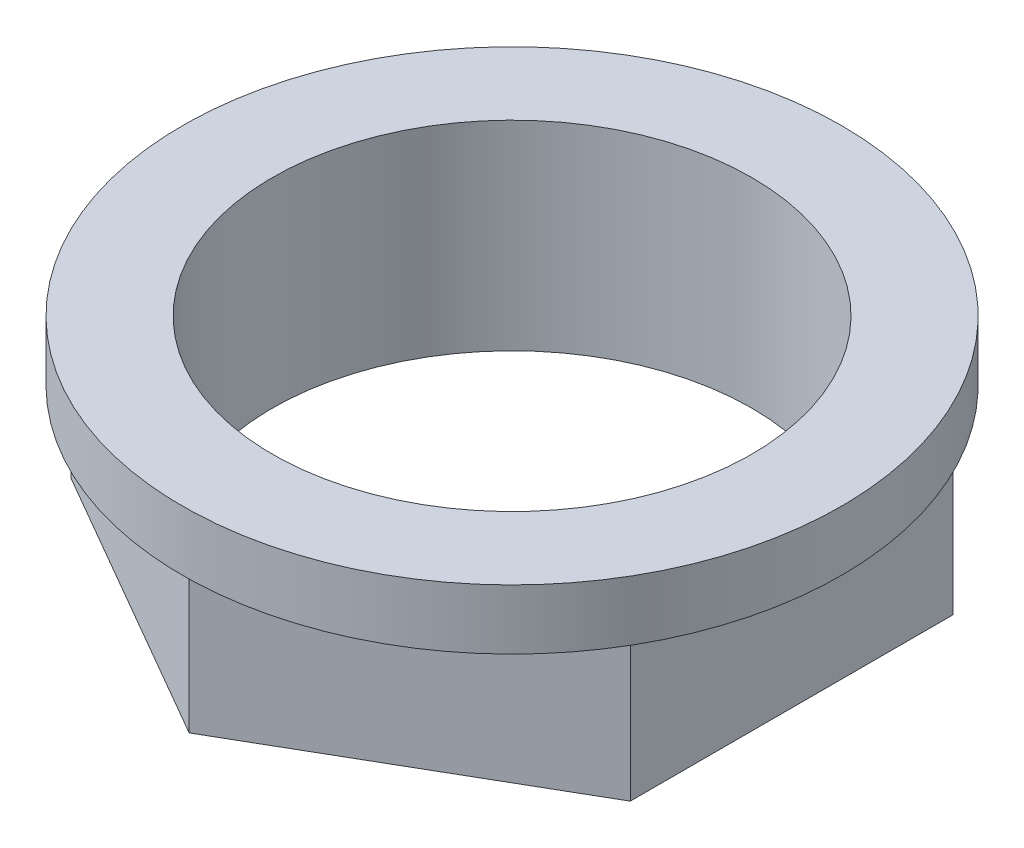
ISO-10303-21;
HEADER;
FILE_DESCRIPTION(('STEP AP214'),'2;1');
FILE_NAME('part.step','',(''),(''),'','','');
FILE_SCHEMA(('AUTOMOTIVE_DESIGN { 1 0 10303 214 1 1 1 1 }'));
ENDSEC;
DATA;
#1=APPLICATION_CONTEXT('core data for automotive mechanical design processes');
#2=APPLICATION_PROTOCOL_DEFINITION('international standard','automotive_design',2000,#1);
#3=PRODUCT_CONTEXT('',#1,'mechanical');
#4=PRODUCT('Part','Part','',(#3));
#5=PRODUCT_RELATED_PRODUCT_CATEGORY('part','',(#4));
#6=PRODUCT_DEFINITION_FORMATION('','',#4);
#7=PRODUCT_DEFINITION_CONTEXT('part definition',#1,'design');
#8=PRODUCT_DEFINITION('design','',#6,#7);
#9=PRODUCT_DEFINITION_SHAPE('','',#8);
#10=(LENGTH_UNIT() NAMED_UNIT(*) SI_UNIT(.MILLI.,.METRE.));
#11=(NAMED_UNIT(*) PLANE_ANGLE_UNIT() SI_UNIT($,.RADIAN.));
#12=(NAMED_UNIT(*) SI_UNIT($,.STERADIAN.) SOLID_ANGLE_UNIT());
#13=UNCERTAINTY_MEASURE_WITH_UNIT(LENGTH_MEASURE(1.E-05),#10,'distance_accuracy_value','');
#14=(GEOMETRIC_REPRESENTATION_CONTEXT(3) GLOBAL_UNCERTAINTY_ASSIGNED_CONTEXT((#13)) GLOBAL_UNIT_ASSIGNED_CONTEXT((#10,
#11,#12)) REPRESENTATION_CONTEXT('',''));
#15=CARTESIAN_POINT('',(0.,0.,0.));
#16=DIRECTION('',(0.,0.,1.));
#17=DIRECTION('',(1.,0.,0.));
#18=AXIS2_PLACEMENT_3D('',#15,#16,#17);
#19=CARTESIAN_POINT('',(0.,-3.49659483037718,0.));
#20=DIRECTION('',(0.,-1.,0.));
#21=DIRECTION('',(0.,0.,-1.));
#22=AXIS2_PLACEMENT_3D('',#19,#20,#21);
#23=CYLINDRICAL_SURFACE('',#22,8.25);
#24=CARTESIAN_POINT('',(0.,0.,0.));
#25=DIRECTION('',(0.,-1.,0.));
#26=DIRECTION('',(0.,0.,-1.));
#27=AXIS2_PLACEMENT_3D('',#24,#25,#26);
#28=CIRCLE('',#27,8.25);
#29=CARTESIAN_POINT('',(0.,0.,-8.25));
#30=VERTEX_POINT('',#29);
#31=EDGE_CURVE('E143',#30,#30,#28,.T.);
#32=ORIENTED_EDGE('',*,*,#31,.T.);
#33=EDGE_LOOP('',(#32));
#34=FACE_BOUND('',#33,.T.);
#35=CARTESIAN_POINT('',(0.,-1.5,0.));
#36=DIRECTION('',(0.,-1.,0.));
#37=DIRECTION('',(0.,0.,-1.));
#38=AXIS2_PLACEMENT_3D('',#35,#36,#37);
#39=CIRCLE('',#38,8.25);
#40=CARTESIAN_POINT('',(0.,-1.5,-8.25));
#41=VERTEX_POINT('',#40);
#42=EDGE_CURVE('E133',#41,#41,#39,.T.);
#43=ORIENTED_EDGE('',*,*,#42,.F.);
#44=EDGE_LOOP('',(#43));
#45=FACE_BOUND('',#44,.T.);
#46=ADVANCED_FACE('F34',(#34,#45),#23,.T.);
#47=CARTESIAN_POINT('',(-8.25,-5.,0.));
#48=DIRECTION('',(0.,1.,0.));
#49=DIRECTION('',(0.,0.,1.));
#50=AXIS2_PLACEMENT_3D('',#47,#48,#49);
#51=PLANE('',#50);
#52=CARTESIAN_POINT('',(0.,-5.,0.));
#53=DIRECTION('',(0.,-1.,0.));
#54=DIRECTION('',(0.,0.,-1.));
#55=AXIS2_PLACEMENT_3D('',#52,#53,#54);
#56=CIRCLE('',#55,6.);
#57=CARTESIAN_POINT('',(0.,-5.,-6.));
#58=VERTEX_POINT('',#57);
#59=EDGE_CURVE('E11',#58,#58,#56,.T.);
#60=ORIENTED_EDGE('',*,*,#59,.F.);
#61=EDGE_LOOP('',(#60));
#62=FACE_BOUND('',#61,.T.);
#63=DIRECTION('',(-0.866025403784438,0.,0.5));
#64=VECTOR('',#63,1.);
#65=CARTESIAN_POINT('',(7.,-5.,4.04145188432738));
#66=LINE('',#65,#64);
#67=CARTESIAN_POINT('',(7.,-5.,4.04145188432738));
#68=VERTEX_POINT('',#67);
#69=CARTESIAN_POINT('',(0.,-5.,8.08290376865476));
#70=VERTEX_POINT('',#69);
#71=EDGE_CURVE('E123',#68,#70,#66,.T.);
#72=ORIENTED_EDGE('',*,*,#71,.T.);
#73=DIRECTION('',(-0.866025403784439,0.,-0.5));
#74=VECTOR('',#73,1.);
#75=CARTESIAN_POINT('',(0.,-5.,8.08290376865476));
#76=LINE('',#75,#74);
#77=CARTESIAN_POINT('',(-7.,-5.,4.04145188432738));
#78=VERTEX_POINT('',#77);
#79=EDGE_CURVE('E92',#70,#78,#76,.T.);
#80=ORIENTED_EDGE('',*,*,#79,.T.);
#81=DIRECTION('',(0.,0.,-1.));
#82=VECTOR('',#81,1.);
#83=CARTESIAN_POINT('',(-7.,-5.,4.04145188432738));
#84=LINE('',#83,#82);
#85=CARTESIAN_POINT('',(-7.,-5.,-4.04145188432738));
#86=VERTEX_POINT('',#85);
#87=EDGE_CURVE('E48',#78,#86,#84,.T.);
#88=ORIENTED_EDGE('',*,*,#87,.T.);
#89=DIRECTION('',(0.866025403784439,0.,-0.5));
#90=VECTOR('',#89,1.);
#91=CARTESIAN_POINT('',(-7.,-5.,-4.04145188432738));
#92=LINE('',#91,#90);
#93=CARTESIAN_POINT('',(0.,-5.,-8.08290376865476));
#94=VERTEX_POINT('',#93);
#95=EDGE_CURVE('E127',#86,#94,#92,.T.);
#96=ORIENTED_EDGE('',*,*,#95,.T.);
#97=DIRECTION('',(0.866025403784439,0.,0.5));
#98=VECTOR('',#97,1.);
#99=CARTESIAN_POINT('',(0.,-5.,-8.08290376865476));
#100=LINE('',#99,#98);
#101=CARTESIAN_POINT('',(7.,-5.,-4.04145188432738));
#102=VERTEX_POINT('',#101);
#103=EDGE_CURVE('E112',#94,#102,#100,.T.);
#104=ORIENTED_EDGE('',*,*,#103,.T.);
#105=DIRECTION('',(0.,0.,1.));
#106=VECTOR('',#105,1.);
#107=CARTESIAN_POINT('',(7.,-5.,-4.04145188432738));
#108=LINE('',#107,#106);
#109=EDGE_CURVE('E109',#102,#68,#108,.T.);
#110=ORIENTED_EDGE('',*,*,#109,.T.);
#111=EDGE_LOOP('',(#72,#80,#88,#96,#104,#110));
#112=FACE_BOUND('',#111,.T.);
#113=ADVANCED_FACE('F153',(#62,#112),#51,.F.);
#114=CARTESIAN_POINT('',(0.,-3.49659483037718,0.));
#115=DIRECTION('',(0.,-1.,0.));
#116=DIRECTION('',(0.,0.,-1.));
#117=AXIS2_PLACEMENT_3D('',#114,#115,#116);
#118=CYLINDRICAL_SURFACE('',#117,6.);
#119=CARTESIAN_POINT('',(0.,0.,0.));
#120=DIRECTION('',(0.,-1.,0.));
#121=DIRECTION('',(0.,0.,-1.));
#122=AXIS2_PLACEMENT_3D('',#119,#120,#121);
#123=CIRCLE('',#122,6.);
#124=CARTESIAN_POINT('',(0.,0.,-6.));
#125=VERTEX_POINT('',#124);
#126=EDGE_CURVE('E41',#125,#125,#123,.T.);
#127=ORIENTED_EDGE('',*,*,#126,.F.);
#128=EDGE_LOOP('',(#127));
#129=FACE_BOUND('',#128,.T.);
#130=ORIENTED_EDGE('',*,*,#59,.T.);
#131=EDGE_LOOP('',(#130));
#132=FACE_BOUND('',#131,.T.);
#133=ADVANCED_FACE('F150',(#129,#132),#118,.F.);
#134=CARTESIAN_POINT('',(-8.25,0.,0.));
#135=DIRECTION('',(0.,-1.,0.));
#136=DIRECTION('',(0.,0.,-1.));
#137=AXIS2_PLACEMENT_3D('',#134,#135,#136);
#138=PLANE('',#137);
#139=ORIENTED_EDGE('',*,*,#31,.F.);
#140=EDGE_LOOP('',(#139));
#141=FACE_BOUND('',#140,.T.);
#142=ORIENTED_EDGE('',*,*,#126,.T.);
#143=EDGE_LOOP('',(#142));
#144=FACE_BOUND('',#143,.T.);
#145=ADVANCED_FACE('F148',(#141,#144),#138,.F.);
#146=CARTESIAN_POINT('',(0.,-1.5,0.));
#147=DIRECTION('',(0.,-1.,0.));
#148=DIRECTION('',(0.,0.,-1.));
#149=AXIS2_PLACEMENT_3D('',#146,#147,#148);
#150=PLANE('',#149);
#151=DIRECTION('',(0.,0.,1.));
#152=VECTOR('',#151,1.);
#153=CARTESIAN_POINT('',(7.,-1.5,-4.04145188432738));
#154=LINE('',#153,#152);
#155=CARTESIAN_POINT('',(7.,-1.5,-4.04145188432738));
#156=VERTEX_POINT('',#155);
#157=CARTESIAN_POINT('',(7.,-1.5,4.04145188432738));
#158=VERTEX_POINT('',#157);
#159=EDGE_CURVE('E98',#156,#158,#154,.T.);
#160=ORIENTED_EDGE('',*,*,#159,.F.);
#161=DIRECTION('',(0.866025403784439,0.,0.5));
#162=VECTOR('',#161,1.);
#163=CARTESIAN_POINT('',(0.,-1.5,-8.08290376865476));
#164=LINE('',#163,#162);
#165=CARTESIAN_POINT('',(0.,-1.5,-8.08290376865476));
#166=VERTEX_POINT('',#165);
#167=EDGE_CURVE('E119',#166,#156,#164,.T.);
#168=ORIENTED_EDGE('',*,*,#167,.F.);
#169=DIRECTION('',(0.866025403784439,0.,-0.5));
#170=VECTOR('',#169,1.);
#171=CARTESIAN_POINT('',(-7.,-1.5,-4.04145188432738));
#172=LINE('',#171,#170);
#173=CARTESIAN_POINT('',(-7.,-1.5,-4.04145188432738));
#174=VERTEX_POINT('',#173);
#175=EDGE_CURVE('E116',#174,#166,#172,.T.);
#176=ORIENTED_EDGE('',*,*,#175,.F.);
#177=DIRECTION('',(0.,0.,-1.));
#178=VECTOR('',#177,1.);
#179=CARTESIAN_POINT('',(-7.,-1.5,4.04145188432738));
#180=LINE('',#179,#178);
#181=CARTESIAN_POINT('',(-7.,-1.5,4.04145188432738));
#182=VERTEX_POINT('',#181);
#183=EDGE_CURVE('E56',#182,#174,#180,.T.);
#184=ORIENTED_EDGE('',*,*,#183,.F.);
#185=DIRECTION('',(-0.866025403784439,0.,-0.5));
#186=VECTOR('',#185,1.);
#187=CARTESIAN_POINT('',(0.,-1.5,8.08290376865476));
#188=LINE('',#187,#186);
#189=CARTESIAN_POINT('',(0.,-1.5,8.08290376865476));
#190=VERTEX_POINT('',#189);
#191=EDGE_CURVE('E90',#190,#182,#188,.T.);
#192=ORIENTED_EDGE('',*,*,#191,.F.);
#193=DIRECTION('',(-0.866025403784438,0.,0.5));
#194=VECTOR('',#193,1.);
#195=CARTESIAN_POINT('',(7.,-1.5,4.04145188432738));
#196=LINE('',#195,#194);
#197=EDGE_CURVE('E104',#158,#190,#196,.T.);
#198=ORIENTED_EDGE('',*,*,#197,.F.);
#199=EDGE_LOOP('',(#160,#168,#176,#184,#192,#198));
#200=FACE_BOUND('',#199,.T.);
#201=ORIENTED_EDGE('',*,*,#42,.T.);
#202=EDGE_LOOP('',(#201));
#203=FACE_BOUND('',#202,.T.);
#204=ADVANCED_FACE('F102',(#200,#203),#150,.T.);
#205=CARTESIAN_POINT('',(7.,-1.5,4.04145188432738));
#206=DIRECTION('',(0.5,0.,0.866025403784438));
#207=DIRECTION('',(0.866025403784439,0.,-0.5));
#208=AXIS2_PLACEMENT_3D('',#205,#206,#207);
#209=PLANE('',#208);
#210=ORIENTED_EDGE('',*,*,#71,.F.);
#211=DIRECTION('',(0.,-1.,0.));
#212=VECTOR('',#211,1.);
#213=CARTESIAN_POINT('',(7.,-1.5,4.04145188432738));
#214=LINE('',#213,#212);
#215=EDGE_CURVE('E108',#158,#68,#214,.T.);
#216=ORIENTED_EDGE('',*,*,#215,.F.);
#217=ORIENTED_EDGE('',*,*,#197,.T.);
#218=DIRECTION('',(0.,-1.,0.));
#219=VECTOR('',#218,1.);
#220=CARTESIAN_POINT('',(0.,-1.5,8.08290376865476));
#221=LINE('',#220,#219);
#222=EDGE_CURVE('E88',#190,#70,#221,.T.);
#223=ORIENTED_EDGE('',*,*,#222,.T.);
#224=EDGE_LOOP('',(#210,#216,#217,#223));
#225=FACE_BOUND('',#224,.T.);
#226=ADVANCED_FACE('F107',(#225),#209,.T.);
#227=CARTESIAN_POINT('',(7.,-1.5,-4.04145188432738));
#228=DIRECTION('',(1.,0.,0.));
#229=DIRECTION('',(0.,0.,-1.));
#230=AXIS2_PLACEMENT_3D('',#227,#228,#229);
#231=PLANE('',#230);
#232=ORIENTED_EDGE('',*,*,#109,.F.);
#233=DIRECTION('',(0.,-1.,0.));
#234=VECTOR('',#233,1.);
#235=CARTESIAN_POINT('',(7.,-1.5,-4.04145188432738));
#236=LINE('',#235,#234);
#237=EDGE_CURVE('E134',#156,#102,#236,.T.);
#238=ORIENTED_EDGE('',*,*,#237,.F.);
#239=ORIENTED_EDGE('',*,*,#159,.T.);
#240=ORIENTED_EDGE('',*,*,#215,.T.);
#241=EDGE_LOOP('',(#232,#238,#239,#240));
#242=FACE_BOUND('',#241,.T.);
#243=ADVANCED_FACE('F162',(#242),#231,.T.);
#244=CARTESIAN_POINT('',(0.,-1.5,-8.08290376865476));
#245=DIRECTION('',(0.5,0.,-0.866025403784439));
#246=DIRECTION('',(-0.866025403784439,0.,-0.5));
#247=AXIS2_PLACEMENT_3D('',#244,#245,#246);
#248=PLANE('',#247);
#249=ORIENTED_EDGE('',*,*,#103,.F.);
#250=DIRECTION('',(0.,-1.,0.));
#251=VECTOR('',#250,1.);
#252=CARTESIAN_POINT('',(0.,-1.5,-8.08290376865476));
#253=LINE('',#252,#251);
#254=EDGE_CURVE('E136',#166,#94,#253,.T.);
#255=ORIENTED_EDGE('',*,*,#254,.F.);
#256=ORIENTED_EDGE('',*,*,#167,.T.);
#257=ORIENTED_EDGE('',*,*,#237,.T.);
#258=EDGE_LOOP('',(#249,#255,#256,#257));
#259=FACE_BOUND('',#258,.T.);
#260=ADVANCED_FACE('F165',(#259),#248,.T.);
#261=CARTESIAN_POINT('',(-7.,-1.5,-4.04145188432738));
#262=DIRECTION('',(-0.5,0.,-0.866025403784439));
#263=DIRECTION('',(-0.866025403784439,0.,0.5));
#264=AXIS2_PLACEMENT_3D('',#261,#262,#263);
#265=PLANE('',#264);
#266=ORIENTED_EDGE('',*,*,#95,.F.);
#267=DIRECTION('',(0.,-1.,0.));
#268=VECTOR('',#267,1.);
#269=CARTESIAN_POINT('',(-7.,-1.5,-4.04145188432738));
#270=LINE('',#269,#268);
#271=EDGE_CURVE('E138',#174,#86,#270,.T.);
#272=ORIENTED_EDGE('',*,*,#271,.F.);
#273=ORIENTED_EDGE('',*,*,#175,.T.);
#274=ORIENTED_EDGE('',*,*,#254,.T.);
#275=EDGE_LOOP('',(#266,#272,#273,#274));
#276=FACE_BOUND('',#275,.T.);
#277=ADVANCED_FACE('F168',(#276),#265,.T.);
#278=CARTESIAN_POINT('',(-7.,-1.5,4.04145188432738));
#279=DIRECTION('',(-1.,0.,0.));
#280=DIRECTION('',(0.,0.,1.));
#281=AXIS2_PLACEMENT_3D('',#278,#279,#280);
#282=PLANE('',#281);
#283=ORIENTED_EDGE('',*,*,#87,.F.);
#284=DIRECTION('',(0.,-1.,0.));
#285=VECTOR('',#284,1.);
#286=CARTESIAN_POINT('',(-7.,-1.5,4.04145188432738));
#287=LINE('',#286,#285);
#288=EDGE_CURVE('E97',#182,#78,#287,.T.);
#289=ORIENTED_EDGE('',*,*,#288,.F.);
#290=ORIENTED_EDGE('',*,*,#183,.T.);
#291=ORIENTED_EDGE('',*,*,#271,.T.);
#292=EDGE_LOOP('',(#283,#289,#290,#291));
#293=FACE_BOUND('',#292,.T.);
#294=ADVANCED_FACE('F169',(#293),#282,.T.);
#295=CARTESIAN_POINT('',(0.,-1.5,8.08290376865476));
#296=DIRECTION('',(-0.5,0.,0.866025403784439));
#297=DIRECTION('',(0.866025403784439,0.,0.5));
#298=AXIS2_PLACEMENT_3D('',#295,#296,#297);
#299=PLANE('',#298);
#300=ORIENTED_EDGE('',*,*,#79,.F.);
#301=ORIENTED_EDGE('',*,*,#222,.F.);
#302=ORIENTED_EDGE('',*,*,#191,.T.);
#303=ORIENTED_EDGE('',*,*,#288,.T.);
#304=EDGE_LOOP('',(#300,#301,#302,#303));
#305=FACE_BOUND('',#304,.T.);
#306=ADVANCED_FACE('F89',(#305),#299,.T.);
#307=CLOSED_SHELL('',(#46,#113,#133,#145,#204,#226,#243,#260,#277,#294,#306));
#308=MANIFOLD_SOLID_BREP('B2',#307);
#309=ADVANCED_BREP_SHAPE_REPRESENTATION('',(#18,#308),#14);
#310=SHAPE_DEFINITION_REPRESENTATION(#9,#309);
ENDSEC;
END-ISO-10303-21;
